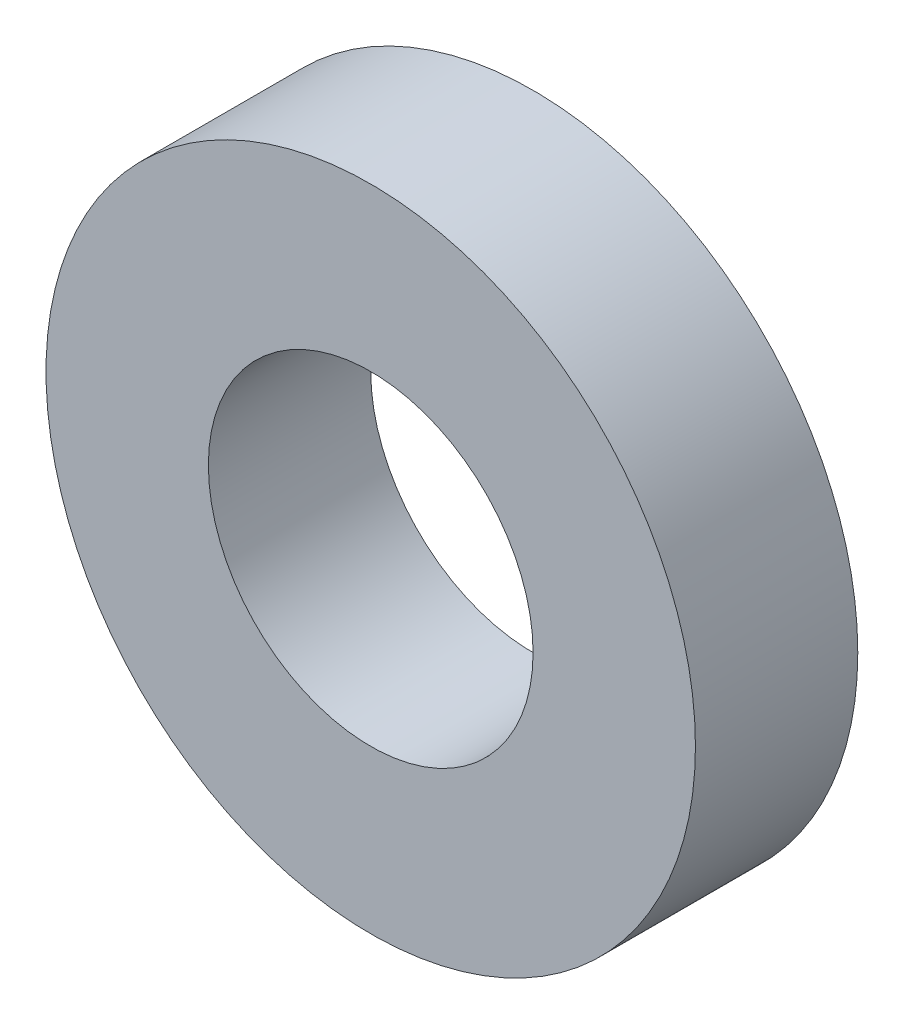
ISO-10303-21;
HEADER;
FILE_DESCRIPTION(('STEP AP214'),'2;1');
FILE_NAME('part.step','',(''),(''),'','','');
FILE_SCHEMA(('AUTOMOTIVE_DESIGN { 1 0 10303 214 1 1 1 1 }'));
ENDSEC;
DATA;
#1=APPLICATION_CONTEXT('core data for automotive mechanical design processes');
#2=APPLICATION_PROTOCOL_DEFINITION('international standard','automotive_design',2000,#1);
#3=PRODUCT_CONTEXT('',#1,'mechanical');
#4=PRODUCT('Part','Part','',(#3));
#5=PRODUCT_RELATED_PRODUCT_CATEGORY('part','',(#4));
#6=PRODUCT_DEFINITION_FORMATION('','',#4);
#7=PRODUCT_DEFINITION_CONTEXT('part definition',#1,'design');
#8=PRODUCT_DEFINITION('design','',#6,#7);
#9=PRODUCT_DEFINITION_SHAPE('','',#8);
#10=(LENGTH_UNIT() NAMED_UNIT(*) SI_UNIT(.MILLI.,.METRE.));
#11=(NAMED_UNIT(*) PLANE_ANGLE_UNIT() SI_UNIT($,.RADIAN.));
#12=(NAMED_UNIT(*) SI_UNIT($,.STERADIAN.) SOLID_ANGLE_UNIT());
#13=UNCERTAINTY_MEASURE_WITH_UNIT(LENGTH_MEASURE(1.E-05),#10,'distance_accuracy_value','');
#14=(GEOMETRIC_REPRESENTATION_CONTEXT(3) GLOBAL_UNCERTAINTY_ASSIGNED_CONTEXT((#13)) GLOBAL_UNIT_ASSIGNED_CONTEXT((#10,
#11,#12)) REPRESENTATION_CONTEXT('',''));
#15=CARTESIAN_POINT('',(0.,0.,0.));
#16=DIRECTION('',(0.,0.,1.));
#17=DIRECTION('',(1.,0.,0.));
#18=AXIS2_PLACEMENT_3D('',#15,#16,#17);
#19=CARTESIAN_POINT('',(0.,0.,3.175));
#20=DIRECTION('',(0.,0.,1.));
#21=DIRECTION('',(1.,0.,0.));
#22=AXIS2_PLACEMENT_3D('',#19,#20,#21);
#23=PLANE('',#22);
#24=CARTESIAN_POINT('',(0.,0.,3.175));
#25=DIRECTION('',(0.,0.,1.));
#26=DIRECTION('',(1.,0.,0.));
#27=AXIS2_PLACEMENT_3D('',#24,#25,#26);
#28=CIRCLE('',#27,6.35);
#29=CARTESIAN_POINT('',(6.35,0.,3.175));
#30=VERTEX_POINT('',#29);
#31=EDGE_CURVE('E10',#30,#30,#28,.T.);
#32=ORIENTED_EDGE('',*,*,#31,.T.);
#33=EDGE_LOOP('',(#32));
#34=FACE_BOUND('',#33,.T.);
#35=CARTESIAN_POINT('',(0.,0.,3.175));
#36=DIRECTION('',(0.,0.,1.));
#37=DIRECTION('',(1.,0.,0.));
#38=AXIS2_PLACEMENT_3D('',#35,#36,#37);
#39=CIRCLE('',#38,3.175);
#40=CARTESIAN_POINT('',(3.175,0.,3.175));
#41=VERTEX_POINT('',#40);
#42=EDGE_CURVE('E43',#41,#41,#39,.T.);
#43=ORIENTED_EDGE('',*,*,#42,.F.);
#44=EDGE_LOOP('',(#43));
#45=FACE_BOUND('',#44,.T.);
#46=ADVANCED_FACE('F32',(#34,#45),#23,.T.);
#47=CARTESIAN_POINT('',(0.,0.,0.));
#48=DIRECTION('',(0.,0.,1.));
#49=DIRECTION('',(1.,0.,0.));
#50=AXIS2_PLACEMENT_3D('',#47,#48,#49);
#51=PLANE('',#50);
#52=CARTESIAN_POINT('',(0.,0.,0.));
#53=DIRECTION('',(0.,0.,1.));
#54=DIRECTION('',(1.,0.,0.));
#55=AXIS2_PLACEMENT_3D('',#52,#53,#54);
#56=CIRCLE('',#55,6.35);
#57=CARTESIAN_POINT('',(6.35,0.,0.));
#58=VERTEX_POINT('',#57);
#59=EDGE_CURVE('E36',#58,#58,#56,.T.);
#60=ORIENTED_EDGE('',*,*,#59,.F.);
#61=EDGE_LOOP('',(#60));
#62=FACE_BOUND('',#61,.T.);
#63=CARTESIAN_POINT('',(0.,0.,0.));
#64=DIRECTION('',(0.,0.,1.));
#65=DIRECTION('',(1.,0.,0.));
#66=AXIS2_PLACEMENT_3D('',#63,#64,#65);
#67=CIRCLE('',#66,3.175);
#68=CARTESIAN_POINT('',(3.175,0.,0.));
#69=VERTEX_POINT('',#68);
#70=EDGE_CURVE('E45',#69,#69,#67,.T.);
#71=ORIENTED_EDGE('',*,*,#70,.T.);
#72=EDGE_LOOP('',(#71));
#73=FACE_BOUND('',#72,.T.);
#74=ADVANCED_FACE('F55',(#62,#73),#51,.F.);
#75=CARTESIAN_POINT('',(0.,0.,3.175));
#76=DIRECTION('',(0.,0.,-1.));
#77=DIRECTION('',(-1.,0.,0.));
#78=AXIS2_PLACEMENT_3D('',#75,#76,#77);
#79=CYLINDRICAL_SURFACE('',#78,6.35);
#80=ORIENTED_EDGE('',*,*,#31,.F.);
#81=EDGE_LOOP('',(#80));
#82=FACE_BOUND('',#81,.T.);
#83=ORIENTED_EDGE('',*,*,#59,.T.);
#84=EDGE_LOOP('',(#83));
#85=FACE_BOUND('',#84,.T.);
#86=ADVANCED_FACE('F34',(#82,#85),#79,.T.);
#87=CARTESIAN_POINT('',(0.,0.,3.175));
#88=DIRECTION('',(0.,0.,-1.));
#89=DIRECTION('',(-1.,0.,0.));
#90=AXIS2_PLACEMENT_3D('',#87,#88,#89);
#91=CYLINDRICAL_SURFACE('',#90,3.175);
#92=ORIENTED_EDGE('',*,*,#42,.T.);
#93=EDGE_LOOP('',(#92));
#94=FACE_BOUND('',#93,.T.);
#95=ORIENTED_EDGE('',*,*,#70,.F.);
#96=EDGE_LOOP('',(#95));
#97=FACE_BOUND('',#96,.T.);
#98=ADVANCED_FACE('F51',(#94,#97),#91,.F.);
#99=CLOSED_SHELL('',(#46,#74,#86,#98));
#100=MANIFOLD_SOLID_BREP('B2',#99);
#101=ADVANCED_BREP_SHAPE_REPRESENTATION('',(#18,#100),#14);
#102=SHAPE_DEFINITION_REPRESENTATION(#9,#101);
ENDSEC;
END-ISO-10303-21;
